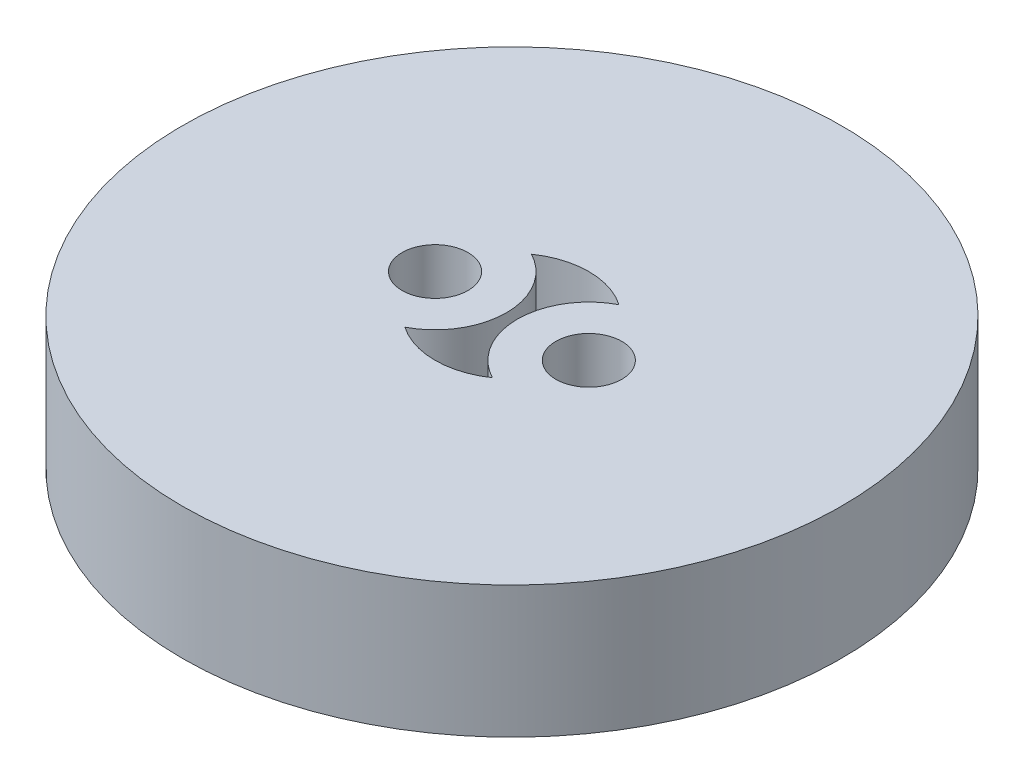
ISO-10303-21;
HEADER;
FILE_DESCRIPTION(('STEP AP214'),'2;1');
FILE_NAME('part.step','',(''),(''),'','','');
FILE_SCHEMA(('AUTOMOTIVE_DESIGN { 1 0 10303 214 1 1 1 1 }'));
ENDSEC;
DATA;
#1=APPLICATION_CONTEXT('core data for automotive mechanical design processes');
#2=APPLICATION_PROTOCOL_DEFINITION('international standard','automotive_design',2000,#1);
#3=PRODUCT_CONTEXT('',#1,'mechanical');
#4=PRODUCT('Part','Part','',(#3));
#5=PRODUCT_RELATED_PRODUCT_CATEGORY('part','',(#4));
#6=PRODUCT_DEFINITION_FORMATION('','',#4);
#7=PRODUCT_DEFINITION_CONTEXT('part definition',#1,'design');
#8=PRODUCT_DEFINITION('design','',#6,#7);
#9=PRODUCT_DEFINITION_SHAPE('','',#8);
#10=(LENGTH_UNIT() NAMED_UNIT(*) SI_UNIT(.MILLI.,.METRE.));
#11=(NAMED_UNIT(*) PLANE_ANGLE_UNIT() SI_UNIT($,.RADIAN.));
#12=(NAMED_UNIT(*) SI_UNIT($,.STERADIAN.) SOLID_ANGLE_UNIT());
#13=UNCERTAINTY_MEASURE_WITH_UNIT(LENGTH_MEASURE(1.E-05),#10,'distance_accuracy_value','');
#14=(GEOMETRIC_REPRESENTATION_CONTEXT(3) GLOBAL_UNCERTAINTY_ASSIGNED_CONTEXT((#13)) GLOBAL_UNIT_ASSIGNED_CONTEXT((#10,
#11,#12)) REPRESENTATION_CONTEXT('',''));
#15=CARTESIAN_POINT('',(0.,0.,0.));
#16=DIRECTION('',(0.,0.,1.));
#17=DIRECTION('',(1.,0.,0.));
#18=AXIS2_PLACEMENT_3D('',#15,#16,#17);
#19=CARTESIAN_POINT('',(0.,6.,0.));
#20=DIRECTION('',(0.,1.,0.));
#21=DIRECTION('',(0.,0.,1.));
#22=AXIS2_PLACEMENT_3D('',#19,#20,#21);
#23=PLANE('',#22);
#24=CARTESIAN_POINT('',(-3.5,6.,0.));
#25=DIRECTION('',(0.,1.,0.));
#26=DIRECTION('',(0.,0.,1.));
#27=AXIS2_PLACEMENT_3D('',#24,#25,#26);
#28=CIRCLE('',#27,1.5);
#29=CARTESIAN_POINT('',(-3.5,6.,1.5));
#30=VERTEX_POINT('',#29);
#31=EDGE_CURVE('E116',#30,#30,#28,.T.);
#32=ORIENTED_EDGE('',*,*,#31,.F.);
#33=EDGE_LOOP('',(#32));
#34=FACE_BOUND('',#33,.T.);
#35=CARTESIAN_POINT('',(0.,6.,0.));
#36=DIRECTION('',(0.,1.,0.));
#37=DIRECTION('',(0.,0.,1.));
#38=AXIS2_PLACEMENT_3D('',#35,#36,#37);
#39=CIRCLE('',#38,15.);
#40=CARTESIAN_POINT('',(0.,6.,15.));
#41=VERTEX_POINT('',#40);
#42=EDGE_CURVE('E11',#41,#41,#39,.T.);
#43=ORIENTED_EDGE('',*,*,#42,.T.);
#44=EDGE_LOOP('',(#43));
#45=FACE_BOUND('',#44,.T.);
#46=CARTESIAN_POINT('',(3.5,6.,0.));
#47=DIRECTION('',(0.,1.,0.));
#48=DIRECTION('',(0.,0.,1.));
#49=AXIS2_PLACEMENT_3D('',#46,#47,#48);
#50=CIRCLE('',#49,1.5);
#51=CARTESIAN_POINT('',(3.5,6.,1.5));
#52=VERTEX_POINT('',#51);
#53=EDGE_CURVE('E110',#52,#52,#50,.T.);
#54=ORIENTED_EDGE('',*,*,#53,.F.);
#55=EDGE_LOOP('',(#54));
#56=FACE_BOUND('',#55,.T.);
#57=CARTESIAN_POINT('',(-3.5,6.,0.));
#58=DIRECTION('',(0.,-1.,0.));
#59=DIRECTION('',(0.,0.,1.));
#60=AXIS2_PLACEMENT_3D('',#57,#58,#59);
#61=CIRCLE('',#60,3.25);
#62=CARTESIAN_POINT('',(-1.99107142857143,6.,-2.87847782105865));
#63=VERTEX_POINT('',#62);
#64=CARTESIAN_POINT('',(-1.99107142857143,6.,2.87847782105865));
#65=VERTEX_POINT('',#64);
#66=EDGE_CURVE('E82',#63,#65,#61,.T.);
#67=ORIENTED_EDGE('',*,*,#66,.F.);
#68=CARTESIAN_POINT('',(0.,6.,0.));
#69=DIRECTION('',(0.,1.,0.));
#70=DIRECTION('',(0.,0.,1.));
#71=AXIS2_PLACEMENT_3D('',#68,#69,#70);
#72=CIRCLE('',#71,3.5);
#73=CARTESIAN_POINT('',(1.99107142857143,6.,-2.87847782105865));
#74=VERTEX_POINT('',#73);
#75=EDGE_CURVE('E74',#74,#63,#72,.T.);
#76=ORIENTED_EDGE('',*,*,#75,.F.);
#77=CARTESIAN_POINT('',(3.5,6.,0.));
#78=DIRECTION('',(0.,-1.,0.));
#79=DIRECTION('',(0.,0.,1.));
#80=AXIS2_PLACEMENT_3D('',#77,#78,#79);
#81=CIRCLE('',#80,3.25);
#82=CARTESIAN_POINT('',(1.99107142857143,6.,2.87847782105865));
#83=VERTEX_POINT('',#82);
#84=EDGE_CURVE('E96',#83,#74,#81,.T.);
#85=ORIENTED_EDGE('',*,*,#84,.F.);
#86=CARTESIAN_POINT('',(0.,6.,0.));
#87=DIRECTION('',(0.,1.,0.));
#88=DIRECTION('',(0.,0.,1.));
#89=AXIS2_PLACEMENT_3D('',#86,#87,#88);
#90=CIRCLE('',#89,3.5);
#91=EDGE_CURVE('E94',#65,#83,#90,.T.);
#92=ORIENTED_EDGE('',*,*,#91,.F.);
#93=EDGE_LOOP('',(#67,#76,#85,#92));
#94=FACE_BOUND('',#93,.T.);
#95=ADVANCED_FACE('F33',(#34,#45,#56,#94),#23,.T.);
#96=CARTESIAN_POINT('',(0.,0.,0.));
#97=DIRECTION('',(0.,1.,0.));
#98=DIRECTION('',(0.,0.,1.));
#99=AXIS2_PLACEMENT_3D('',#96,#97,#98);
#100=PLANE('',#99);
#101=CARTESIAN_POINT('',(3.5,0.,0.));
#102=DIRECTION('',(0.,1.,0.));
#103=DIRECTION('',(0.,0.,1.));
#104=AXIS2_PLACEMENT_3D('',#101,#102,#103);
#105=CIRCLE('',#104,1.5);
#106=CARTESIAN_POINT('',(3.5,0.,1.5));
#107=VERTEX_POINT('',#106);
#108=EDGE_CURVE('E90',#107,#107,#105,.T.);
#109=ORIENTED_EDGE('',*,*,#108,.T.);
#110=EDGE_LOOP('',(#109));
#111=FACE_BOUND('',#110,.T.);
#112=CARTESIAN_POINT('',(-3.5,0.,0.));
#113=DIRECTION('',(0.,1.,0.));
#114=DIRECTION('',(0.,0.,1.));
#115=AXIS2_PLACEMENT_3D('',#112,#113,#114);
#116=CIRCLE('',#115,1.5);
#117=CARTESIAN_POINT('',(-3.5,0.,1.5));
#118=VERTEX_POINT('',#117);
#119=EDGE_CURVE('E113',#118,#118,#116,.T.);
#120=ORIENTED_EDGE('',*,*,#119,.T.);
#121=EDGE_LOOP('',(#120));
#122=FACE_BOUND('',#121,.T.);
#123=CARTESIAN_POINT('',(0.,0.,0.));
#124=DIRECTION('',(0.,1.,0.));
#125=DIRECTION('',(0.,0.,1.));
#126=AXIS2_PLACEMENT_3D('',#123,#124,#125);
#127=CIRCLE('',#126,15.);
#128=CARTESIAN_POINT('',(0.,0.,15.));
#129=VERTEX_POINT('',#128);
#130=EDGE_CURVE('E37',#129,#129,#127,.T.);
#131=ORIENTED_EDGE('',*,*,#130,.F.);
#132=EDGE_LOOP('',(#131));
#133=FACE_BOUND('',#132,.T.);
#134=CARTESIAN_POINT('',(0.,0.,0.));
#135=DIRECTION('',(0.,1.,0.));
#136=DIRECTION('',(0.,0.,1.));
#137=AXIS2_PLACEMENT_3D('',#134,#135,#136);
#138=CIRCLE('',#137,3.5);
#139=CARTESIAN_POINT('',(1.99107142857143,0.,-2.87847782105865));
#140=VERTEX_POINT('',#139);
#141=CARTESIAN_POINT('',(-1.99107142857143,0.,-2.87847782105865));
#142=VERTEX_POINT('',#141);
#143=EDGE_CURVE('E56',#140,#142,#138,.T.);
#144=ORIENTED_EDGE('',*,*,#143,.T.);
#145=CARTESIAN_POINT('',(-3.5,0.,0.));
#146=DIRECTION('',(0.,-1.,0.));
#147=DIRECTION('',(0.,0.,1.));
#148=AXIS2_PLACEMENT_3D('',#145,#146,#147);
#149=CIRCLE('',#148,3.25);
#150=CARTESIAN_POINT('',(-1.99107142857143,0.,2.87847782105865));
#151=VERTEX_POINT('',#150);
#152=EDGE_CURVE('E89',#142,#151,#149,.T.);
#153=ORIENTED_EDGE('',*,*,#152,.T.);
#154=CARTESIAN_POINT('',(0.,0.,0.));
#155=DIRECTION('',(0.,1.,0.));
#156=DIRECTION('',(0.,0.,1.));
#157=AXIS2_PLACEMENT_3D('',#154,#155,#156);
#158=CIRCLE('',#157,3.5);
#159=CARTESIAN_POINT('',(1.99107142857143,0.,2.87847782105865));
#160=VERTEX_POINT('',#159);
#161=EDGE_CURVE('E102',#151,#160,#158,.T.);
#162=ORIENTED_EDGE('',*,*,#161,.T.);
#163=CARTESIAN_POINT('',(3.5,0.,0.));
#164=DIRECTION('',(0.,-1.,0.));
#165=DIRECTION('',(0.,0.,1.));
#166=AXIS2_PLACEMENT_3D('',#163,#164,#165);
#167=CIRCLE('',#166,3.25);
#168=EDGE_CURVE('E83',#160,#140,#167,.T.);
#169=ORIENTED_EDGE('',*,*,#168,.T.);
#170=EDGE_LOOP('',(#144,#153,#162,#169));
#171=FACE_BOUND('',#170,.T.);
#172=ADVANCED_FACE('F122',(#111,#122,#133,#171),#100,.F.);
#173=CARTESIAN_POINT('',(0.,6.,0.));
#174=DIRECTION('',(0.,-1.,0.));
#175=DIRECTION('',(0.,0.,-1.));
#176=AXIS2_PLACEMENT_3D('',#173,#174,#175);
#177=CYLINDRICAL_SURFACE('',#176,15.);
#178=ORIENTED_EDGE('',*,*,#42,.F.);
#179=EDGE_LOOP('',(#178));
#180=FACE_BOUND('',#179,.T.);
#181=ORIENTED_EDGE('',*,*,#130,.T.);
#182=EDGE_LOOP('',(#181));
#183=FACE_BOUND('',#182,.T.);
#184=ADVANCED_FACE('F35',(#180,#183),#177,.T.);
#185=CARTESIAN_POINT('',(-3.5,6.,0.));
#186=DIRECTION('',(0.,-1.,0.));
#187=DIRECTION('',(0.,0.,-1.));
#188=AXIS2_PLACEMENT_3D('',#185,#186,#187);
#189=CYLINDRICAL_SURFACE('',#188,1.5);
#190=ORIENTED_EDGE('',*,*,#31,.T.);
#191=EDGE_LOOP('',(#190));
#192=FACE_BOUND('',#191,.T.);
#193=ORIENTED_EDGE('',*,*,#119,.F.);
#194=EDGE_LOOP('',(#193));
#195=FACE_BOUND('',#194,.T.);
#196=ADVANCED_FACE('F125',(#192,#195),#189,.F.);
#197=CARTESIAN_POINT('',(3.5,6.,0.));
#198=DIRECTION('',(0.,-1.,0.));
#199=DIRECTION('',(0.,0.,-1.));
#200=AXIS2_PLACEMENT_3D('',#197,#198,#199);
#201=CYLINDRICAL_SURFACE('',#200,1.5);
#202=ORIENTED_EDGE('',*,*,#53,.T.);
#203=EDGE_LOOP('',(#202));
#204=FACE_BOUND('',#203,.T.);
#205=ORIENTED_EDGE('',*,*,#108,.F.);
#206=EDGE_LOOP('',(#205));
#207=FACE_BOUND('',#206,.T.);
#208=ADVANCED_FACE('F127',(#204,#207),#201,.F.);
#209=CARTESIAN_POINT('',(0.,6.,0.));
#210=DIRECTION('',(0.,-1.,0.));
#211=DIRECTION('',(0.,0.,-1.));
#212=AXIS2_PLACEMENT_3D('',#209,#210,#211);
#213=CYLINDRICAL_SURFACE('',#212,3.5);
#214=ORIENTED_EDGE('',*,*,#143,.F.);
#215=DIRECTION('',(0.,-1.,0.));
#216=VECTOR('',#215,1.);
#217=CARTESIAN_POINT('',(1.99107142857143,6.,-2.87847782105865));
#218=LINE('',#217,#216);
#219=EDGE_CURVE('E78',#74,#140,#218,.T.);
#220=ORIENTED_EDGE('',*,*,#219,.F.);
#221=ORIENTED_EDGE('',*,*,#75,.T.);
#222=DIRECTION('',(0.,-1.,0.));
#223=VECTOR('',#222,1.);
#224=CARTESIAN_POINT('',(-1.99107142857143,6.,-2.87847782105865));
#225=LINE('',#224,#223);
#226=EDGE_CURVE('E77',#63,#142,#225,.T.);
#227=ORIENTED_EDGE('',*,*,#226,.T.);
#228=EDGE_LOOP('',(#214,#220,#221,#227));
#229=FACE_BOUND('',#228,.T.);
#230=ADVANCED_FACE('F76',(#229),#213,.F.);
#231=CARTESIAN_POINT('',(-3.5,6.,0.));
#232=DIRECTION('',(0.,-1.,0.));
#233=DIRECTION('',(0.,0.,-1.));
#234=AXIS2_PLACEMENT_3D('',#231,#232,#233);
#235=CYLINDRICAL_SURFACE('',#234,3.25);
#236=ORIENTED_EDGE('',*,*,#152,.F.);
#237=ORIENTED_EDGE('',*,*,#226,.F.);
#238=ORIENTED_EDGE('',*,*,#66,.T.);
#239=DIRECTION('',(0.,-1.,0.));
#240=VECTOR('',#239,1.);
#241=CARTESIAN_POINT('',(-1.99107142857143,6.,2.87847782105865));
#242=LINE('',#241,#240);
#243=EDGE_CURVE('E91',#65,#151,#242,.T.);
#244=ORIENTED_EDGE('',*,*,#243,.T.);
#245=EDGE_LOOP('',(#236,#237,#238,#244));
#246=FACE_BOUND('',#245,.T.);
#247=ADVANCED_FACE('F86',(#246),#235,.T.);
#248=CARTESIAN_POINT('',(0.,6.,0.));
#249=DIRECTION('',(0.,-1.,0.));
#250=DIRECTION('',(0.,0.,-1.));
#251=AXIS2_PLACEMENT_3D('',#248,#249,#250);
#252=CYLINDRICAL_SURFACE('',#251,3.5);
#253=ORIENTED_EDGE('',*,*,#161,.F.);
#254=ORIENTED_EDGE('',*,*,#243,.F.);
#255=ORIENTED_EDGE('',*,*,#91,.T.);
#256=DIRECTION('',(0.,-1.,0.));
#257=VECTOR('',#256,1.);
#258=CARTESIAN_POINT('',(1.99107142857143,6.,2.87847782105865));
#259=LINE('',#258,#257);
#260=EDGE_CURVE('E48',#83,#160,#259,.T.);
#261=ORIENTED_EDGE('',*,*,#260,.T.);
#262=EDGE_LOOP('',(#253,#254,#255,#261));
#263=FACE_BOUND('',#262,.T.);
#264=ADVANCED_FACE('F158',(#263),#252,.F.);
#265=CARTESIAN_POINT('',(3.5,6.,0.));
#266=DIRECTION('',(0.,-1.,0.));
#267=DIRECTION('',(0.,0.,-1.));
#268=AXIS2_PLACEMENT_3D('',#265,#266,#267);
#269=CYLINDRICAL_SURFACE('',#268,3.25);
#270=ORIENTED_EDGE('',*,*,#168,.F.);
#271=ORIENTED_EDGE('',*,*,#260,.F.);
#272=ORIENTED_EDGE('',*,*,#84,.T.);
#273=ORIENTED_EDGE('',*,*,#219,.T.);
#274=EDGE_LOOP('',(#270,#271,#272,#273));
#275=FACE_BOUND('',#274,.T.);
#276=ADVANCED_FACE('F156',(#275),#269,.T.);
#277=CLOSED_SHELL('',(#95,#172,#184,#196,#208,#230,#247,#264,#276));
#278=MANIFOLD_SOLID_BREP('B2',#277);
#279=ADVANCED_BREP_SHAPE_REPRESENTATION('',(#18,#278),#14);
#280=SHAPE_DEFINITION_REPRESENTATION(#9,#279);
ENDSEC;
END-ISO-10303-21;
